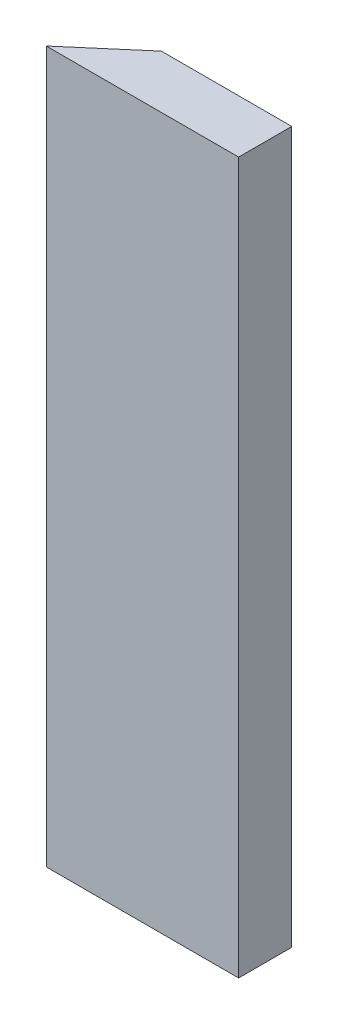
ISO-10303-21;
HEADER;
FILE_DESCRIPTION(('STEP AP214'),'2;1');
FILE_NAME('part.step','',(''),(''),'','','');
FILE_SCHEMA(('AUTOMOTIVE_DESIGN { 1 0 10303 214 1 1 1 1 }'));
ENDSEC;
DATA;
#1=APPLICATION_CONTEXT('core data for automotive mechanical design processes');
#2=APPLICATION_PROTOCOL_DEFINITION('international standard','automotive_design',2000,#1);
#3=PRODUCT_CONTEXT('',#1,'mechanical');
#4=PRODUCT('Part','Part','',(#3));
#5=PRODUCT_RELATED_PRODUCT_CATEGORY('part','',(#4));
#6=PRODUCT_DEFINITION_FORMATION('','',#4);
#7=PRODUCT_DEFINITION_CONTEXT('part definition',#1,'design');
#8=PRODUCT_DEFINITION('design','',#6,#7);
#9=PRODUCT_DEFINITION_SHAPE('','',#8);
#10=(LENGTH_UNIT() NAMED_UNIT(*) SI_UNIT(.MILLI.,.METRE.));
#11=(NAMED_UNIT(*) PLANE_ANGLE_UNIT() SI_UNIT($,.RADIAN.));
#12=(NAMED_UNIT(*) SI_UNIT($,.STERADIAN.) SOLID_ANGLE_UNIT());
#13=UNCERTAINTY_MEASURE_WITH_UNIT(LENGTH_MEASURE(1.E-05),#10,'distance_accuracy_value','');
#14=(GEOMETRIC_REPRESENTATION_CONTEXT(3) GLOBAL_UNCERTAINTY_ASSIGNED_CONTEXT((#13)) GLOBAL_UNIT_ASSIGNED_CONTEXT((#10,
#11,#12)) REPRESENTATION_CONTEXT('',''));
#15=CARTESIAN_POINT('',(0.,0.,0.));
#16=DIRECTION('',(0.,0.,1.));
#17=DIRECTION('',(1.,0.,0.));
#18=AXIS2_PLACEMENT_3D('',#15,#16,#17);
#19=CARTESIAN_POINT('',(60.,170.,0.));
#20=DIRECTION('',(0.,0.,-1.));
#21=DIRECTION('',(-1.,0.,0.));
#22=AXIS2_PLACEMENT_3D('',#19,#20,#21);
#23=PLANE('',#22);
#24=DIRECTION('',(1.,0.,0.));
#25=VECTOR('',#24,1.);
#26=CARTESIAN_POINT('',(60.,0.,0.));
#27=LINE('',#26,#25);
#28=CARTESIAN_POINT('',(0.,0.,0.));
#29=VERTEX_POINT('',#28);
#30=CARTESIAN_POINT('',(46.,0.,0.));
#31=VERTEX_POINT('',#30);
#32=EDGE_CURVE('E102',#29,#31,#27,.T.);
#33=ORIENTED_EDGE('',*,*,#32,.T.);
#34=DIRECTION('',(0.,1.,0.));
#35=VECTOR('',#34,1.);
#36=CARTESIAN_POINT('',(46.,170.,0.));
#37=LINE('',#36,#35);
#38=CARTESIAN_POINT('',(46.,170.,0.));
#39=VERTEX_POINT('',#38);
#40=EDGE_CURVE('E82',#31,#39,#37,.T.);
#41=ORIENTED_EDGE('',*,*,#40,.T.);
#42=DIRECTION('',(1.,0.,0.));
#43=VECTOR('',#42,1.);
#44=CARTESIAN_POINT('',(60.,170.,0.));
#45=LINE('',#44,#43);
#46=CARTESIAN_POINT('',(0.,170.,0.));
#47=VERTEX_POINT('',#46);
#48=EDGE_CURVE('E96',#47,#39,#45,.T.);
#49=ORIENTED_EDGE('',*,*,#48,.F.);
#50=DIRECTION('',(0.,-1.,0.));
#51=VECTOR('',#50,1.);
#52=CARTESIAN_POINT('',(0.,170.,0.));
#53=LINE('',#52,#51);
#54=EDGE_CURVE('E45',#47,#29,#53,.T.);
#55=ORIENTED_EDGE('',*,*,#54,.T.);
#56=EDGE_LOOP('',(#33,#41,#49,#55));
#57=FACE_BOUND('',#56,.T.);
#58=ADVANCED_FACE('F38',(#57),#23,.F.);
#59=CARTESIAN_POINT('',(0.,170.,0.));
#60=DIRECTION('',(0.650774217265847,0.,0.759271307334884));
#61=DIRECTION('',(0.759271307334884,0.,-0.650774217265847));
#62=AXIS2_PLACEMENT_3D('',#59,#60,#61);
#63=PLANE('',#62);
#64=DIRECTION('',(-0.759271307334884,0.,0.650774217265847));
#65=VECTOR('',#64,1.);
#66=CARTESIAN_POINT('',(0.,170.,0.));
#67=LINE('',#66,#65);
#68=CARTESIAN_POINT('',(14.8173442452375,170.,-12.7));
#69=VERTEX_POINT('',#68);
#70=EDGE_CURVE('E88',#69,#47,#67,.T.);
#71=ORIENTED_EDGE('',*,*,#70,.F.);
#72=DIRECTION('',(0.,-1.,0.));
#73=VECTOR('',#72,1.);
#74=CARTESIAN_POINT('',(14.8173442452375,170.,-12.7));
#75=LINE('',#74,#73);
#76=CARTESIAN_POINT('',(14.8173442452375,0.,-12.7));
#77=VERTEX_POINT('',#76);
#78=EDGE_CURVE('E76',#69,#77,#75,.T.);
#79=ORIENTED_EDGE('',*,*,#78,.T.);
#80=DIRECTION('',(-0.759271307334884,0.,0.650774217265847));
#81=VECTOR('',#80,1.);
#82=CARTESIAN_POINT('',(0.,0.,0.));
#83=LINE('',#82,#81);
#84=EDGE_CURVE('E98',#77,#29,#83,.T.);
#85=ORIENTED_EDGE('',*,*,#84,.T.);
#86=ORIENTED_EDGE('',*,*,#54,.F.);
#87=EDGE_LOOP('',(#71,#79,#85,#86));
#88=FACE_BOUND('',#87,.T.);
#89=ADVANCED_FACE('F93',(#88),#63,.F.);
#90=CARTESIAN_POINT('',(0.,170.,0.));
#91=DIRECTION('',(0.,1.,0.));
#92=DIRECTION('',(0.,0.,1.));
#93=AXIS2_PLACEMENT_3D('',#90,#91,#92);
#94=PLANE('',#93);
#95=DIRECTION('',(-1.,0.,0.));
#96=VECTOR('',#95,1.);
#97=CARTESIAN_POINT('',(46.,170.,-12.7));
#98=LINE('',#97,#96);
#99=CARTESIAN_POINT('',(46.,170.,-12.7));
#100=VERTEX_POINT('',#99);
#101=EDGE_CURVE('E52',#100,#69,#98,.T.);
#102=ORIENTED_EDGE('',*,*,#101,.T.);
#103=ORIENTED_EDGE('',*,*,#70,.T.);
#104=ORIENTED_EDGE('',*,*,#48,.T.);
#105=DIRECTION('',(0.,0.,-1.));
#106=VECTOR('',#105,1.);
#107=CARTESIAN_POINT('',(46.,170.,0.));
#108=LINE('',#107,#106);
#109=EDGE_CURVE('E90',#39,#100,#108,.T.);
#110=ORIENTED_EDGE('',*,*,#109,.T.);
#111=EDGE_LOOP('',(#102,#103,#104,#110));
#112=FACE_BOUND('',#111,.T.);
#113=ADVANCED_FACE('F86',(#112),#94,.T.);
#114=CARTESIAN_POINT('',(0.,0.,0.));
#115=DIRECTION('',(0.,1.,0.));
#116=DIRECTION('',(0.,0.,1.));
#117=AXIS2_PLACEMENT_3D('',#114,#115,#116);
#118=PLANE('',#117);
#119=ORIENTED_EDGE('',*,*,#84,.F.);
#120=DIRECTION('',(1.,0.,0.));
#121=VECTOR('',#120,1.);
#122=CARTESIAN_POINT('',(0.,0.,-12.7));
#123=LINE('',#122,#121);
#124=CARTESIAN_POINT('',(46.,0.,-12.7));
#125=VERTEX_POINT('',#124);
#126=EDGE_CURVE('E78',#77,#125,#123,.T.);
#127=ORIENTED_EDGE('',*,*,#126,.T.);
#128=DIRECTION('',(0.,0.,1.));
#129=VECTOR('',#128,1.);
#130=CARTESIAN_POINT('',(46.,0.,0.));
#131=LINE('',#130,#129);
#132=EDGE_CURVE('E11',#125,#31,#131,.T.);
#133=ORIENTED_EDGE('',*,*,#132,.T.);
#134=ORIENTED_EDGE('',*,*,#32,.F.);
#135=EDGE_LOOP('',(#119,#127,#133,#134));
#136=FACE_BOUND('',#135,.T.);
#137=ADVANCED_FACE('F107',(#136),#118,.F.);
#138=CARTESIAN_POINT('',(46.,170.,0.));
#139=DIRECTION('',(-1.,0.,0.));
#140=DIRECTION('',(0.,-1.,0.));
#141=AXIS2_PLACEMENT_3D('',#138,#139,#140);
#142=PLANE('',#141);
#143=ORIENTED_EDGE('',*,*,#132,.F.);
#144=DIRECTION('',(0.,-1.,0.));
#145=VECTOR('',#144,1.);
#146=CARTESIAN_POINT('',(46.,170.,-12.7));
#147=LINE('',#146,#145);
#148=EDGE_CURVE('E91',#100,#125,#147,.T.);
#149=ORIENTED_EDGE('',*,*,#148,.F.);
#150=ORIENTED_EDGE('',*,*,#109,.F.);
#151=ORIENTED_EDGE('',*,*,#40,.F.);
#152=EDGE_LOOP('',(#143,#149,#150,#151));
#153=FACE_BOUND('',#152,.T.);
#154=ADVANCED_FACE('F109',(#153),#142,.F.);
#155=CARTESIAN_POINT('',(46.,170.,-12.7));
#156=DIRECTION('',(0.,0.,1.));
#157=DIRECTION('',(1.,0.,0.));
#158=AXIS2_PLACEMENT_3D('',#155,#156,#157);
#159=PLANE('',#158);
#160=ORIENTED_EDGE('',*,*,#101,.F.);
#161=ORIENTED_EDGE('',*,*,#148,.T.);
#162=ORIENTED_EDGE('',*,*,#126,.F.);
#163=ORIENTED_EDGE('',*,*,#78,.F.);
#164=EDGE_LOOP('',(#160,#161,#162,#163));
#165=FACE_BOUND('',#164,.T.);
#166=ADVANCED_FACE('F77',(#165),#159,.F.);
#167=CLOSED_SHELL('',(#58,#89,#113,#137,#154,#166));
#168=MANIFOLD_SOLID_BREP('B2',#167);
#169=ADVANCED_BREP_SHAPE_REPRESENTATION('',(#18,#168),#14);
#170=SHAPE_DEFINITION_REPRESENTATION(#9,#169);
ENDSEC;
END-ISO-10303-21;
